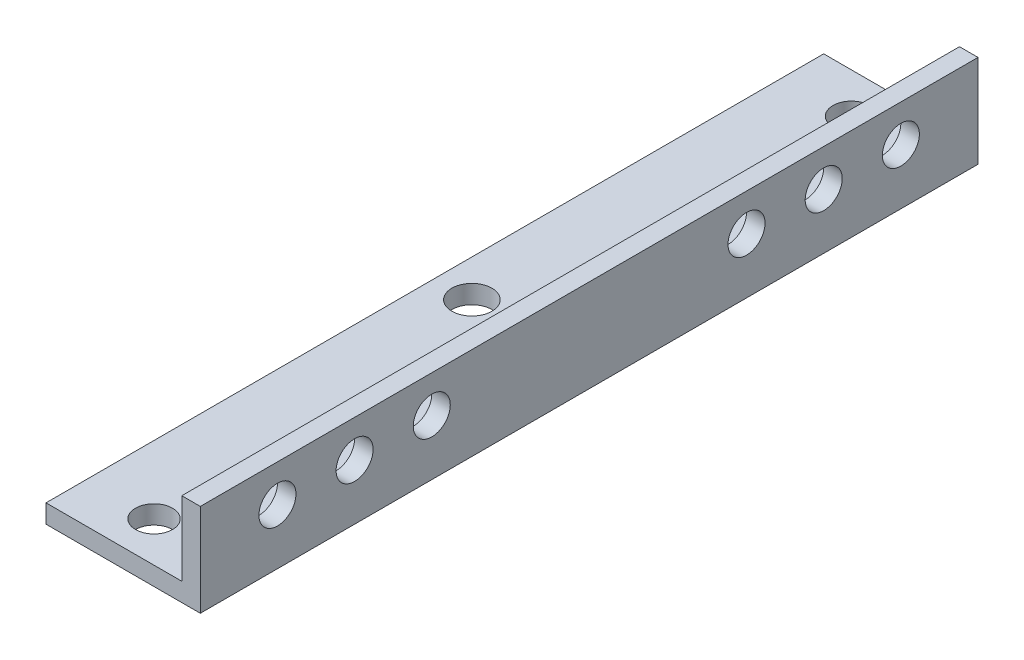
ISO-10303-21;
HEADER;
FILE_DESCRIPTION(('STEP AP214'),'2;1');
FILE_NAME('part.step','',(''),(''),'','','');
FILE_SCHEMA(('AUTOMOTIVE_DESIGN { 1 0 10303 214 1 1 1 1 }'));
ENDSEC;
DATA;
#1=APPLICATION_CONTEXT('core data for automotive mechanical design processes');
#2=APPLICATION_PROTOCOL_DEFINITION('international standard','automotive_design',2000,#1);
#3=PRODUCT_CONTEXT('',#1,'mechanical');
#4=PRODUCT('Part','Part','',(#3));
#5=PRODUCT_RELATED_PRODUCT_CATEGORY('part','',(#4));
#6=PRODUCT_DEFINITION_FORMATION('','',#4);
#7=PRODUCT_DEFINITION_CONTEXT('part definition',#1,'design');
#8=PRODUCT_DEFINITION('design','',#6,#7);
#9=PRODUCT_DEFINITION_SHAPE('','',#8);
#10=(LENGTH_UNIT() NAMED_UNIT(*) SI_UNIT(.MILLI.,.METRE.));
#11=(NAMED_UNIT(*) PLANE_ANGLE_UNIT() SI_UNIT($,.RADIAN.));
#12=(NAMED_UNIT(*) SI_UNIT($,.STERADIAN.) SOLID_ANGLE_UNIT());
#13=UNCERTAINTY_MEASURE_WITH_UNIT(LENGTH_MEASURE(1.E-05),#10,'distance_accuracy_value','');
#14=(GEOMETRIC_REPRESENTATION_CONTEXT(3) GLOBAL_UNCERTAINTY_ASSIGNED_CONTEXT((#13)) GLOBAL_UNIT_ASSIGNED_CONTEXT((#10,
#11,#12)) REPRESENTATION_CONTEXT('',''));
#15=CARTESIAN_POINT('',(0.,0.,0.));
#16=DIRECTION('',(0.,0.,1.));
#17=DIRECTION('',(1.,0.,0.));
#18=AXIS2_PLACEMENT_3D('',#15,#16,#17);
#19=CARTESIAN_POINT('',(0.,-12.,126.));
#20=DIRECTION('',(1.,0.,0.));
#21=DIRECTION('',(0.,0.,-1.));
#22=AXIS2_PLACEMENT_3D('',#19,#20,#21);
#23=PLANE('',#22);
#24=CARTESIAN_POINT('',(0.,-6.,12.5));
#25=DIRECTION('',(1.,0.,0.));
#26=DIRECTION('',(0.,0.,-1.));
#27=AXIS2_PLACEMENT_3D('',#24,#25,#26);
#28=CIRCLE('',#27,3.00000000000001);
#29=CARTESIAN_POINT('',(0.,-6.,9.49999999999999));
#30=VERTEX_POINT('',#29);
#31=EDGE_CURVE('E135',#30,#30,#28,.T.);
#32=ORIENTED_EDGE('',*,*,#31,.T.);
#33=EDGE_LOOP('',(#32));
#34=FACE_BOUND('',#33,.T.);
#35=CARTESIAN_POINT('',(0.,-6.,37.5));
#36=DIRECTION('',(1.,0.,0.));
#37=DIRECTION('',(0.,0.,-1.));
#38=AXIS2_PLACEMENT_3D('',#35,#36,#37);
#39=CIRCLE('',#38,3.00000000000001);
#40=CARTESIAN_POINT('',(0.,-6.,34.5));
#41=VERTEX_POINT('',#40);
#42=EDGE_CURVE('E181',#41,#41,#39,.T.);
#43=ORIENTED_EDGE('',*,*,#42,.T.);
#44=EDGE_LOOP('',(#43));
#45=FACE_BOUND('',#44,.T.);
#46=CARTESIAN_POINT('',(0.,-6.,25.));
#47=DIRECTION('',(1.,0.,0.));
#48=DIRECTION('',(0.,0.,-1.));
#49=AXIS2_PLACEMENT_3D('',#46,#47,#48);
#50=CIRCLE('',#49,3.00000000000001);
#51=CARTESIAN_POINT('',(0.,-6.,22.));
#52=VERTEX_POINT('',#51);
#53=EDGE_CURVE('E176',#52,#52,#50,.T.);
#54=ORIENTED_EDGE('',*,*,#53,.T.);
#55=EDGE_LOOP('',(#54));
#56=FACE_BOUND('',#55,.T.);
#57=CARTESIAN_POINT('',(0.,-6.,88.5));
#58=DIRECTION('',(1.,0.,0.));
#59=DIRECTION('',(0.,0.,-1.));
#60=AXIS2_PLACEMENT_3D('',#57,#58,#59);
#61=CIRCLE('',#60,3.00000000000001);
#62=CARTESIAN_POINT('',(0.,-6.,85.5));
#63=VERTEX_POINT('',#62);
#64=EDGE_CURVE('E171',#63,#63,#61,.T.);
#65=ORIENTED_EDGE('',*,*,#64,.T.);
#66=EDGE_LOOP('',(#65));
#67=FACE_BOUND('',#66,.T.);
#68=CARTESIAN_POINT('',(0.,-6.,101.));
#69=DIRECTION('',(1.,0.,0.));
#70=DIRECTION('',(0.,0.,-1.));
#71=AXIS2_PLACEMENT_3D('',#68,#69,#70);
#72=CIRCLE('',#71,3.00000000000001);
#73=CARTESIAN_POINT('',(0.,-6.,98.));
#74=VERTEX_POINT('',#73);
#75=EDGE_CURVE('E166',#74,#74,#72,.T.);
#76=ORIENTED_EDGE('',*,*,#75,.T.);
#77=EDGE_LOOP('',(#76));
#78=FACE_BOUND('',#77,.T.);
#79=CARTESIAN_POINT('',(0.,-6.,113.5));
#80=DIRECTION('',(1.,0.,0.));
#81=DIRECTION('',(0.,0.,-1.));
#82=AXIS2_PLACEMENT_3D('',#79,#80,#81);
#83=CIRCLE('',#82,3.00000000000001);
#84=CARTESIAN_POINT('',(0.,-6.,110.5));
#85=VERTEX_POINT('',#84);
#86=EDGE_CURVE('E161',#85,#85,#83,.T.);
#87=ORIENTED_EDGE('',*,*,#86,.T.);
#88=EDGE_LOOP('',(#87));
#89=FACE_BOUND('',#88,.T.);
#90=DIRECTION('',(0.,-1.,0.));
#91=VECTOR('',#90,1.);
#92=CARTESIAN_POINT('',(0.,-12.,0.));
#93=LINE('',#92,#91);
#94=CARTESIAN_POINT('',(0.,0.,0.));
#95=VERTEX_POINT('',#94);
#96=CARTESIAN_POINT('',(0.,-12.,0.));
#97=VERTEX_POINT('',#96);
#98=EDGE_CURVE('E130',#95,#97,#93,.T.);
#99=ORIENTED_EDGE('',*,*,#98,.T.);
#100=DIRECTION('',(0.,0.,-1.));
#101=VECTOR('',#100,1.);
#102=CARTESIAN_POINT('',(0.,-12.,126.));
#103=LINE('',#102,#101);
#104=CARTESIAN_POINT('',(0.,-12.,126.));
#105=VERTEX_POINT('',#104);
#106=EDGE_CURVE('E11',#105,#97,#103,.T.);
#107=ORIENTED_EDGE('',*,*,#106,.F.);
#108=DIRECTION('',(0.,-1.,0.));
#109=VECTOR('',#108,1.);
#110=CARTESIAN_POINT('',(0.,-12.,126.));
#111=LINE('',#110,#109);
#112=CARTESIAN_POINT('',(0.,0.,126.));
#113=VERTEX_POINT('',#112);
#114=EDGE_CURVE('E147',#113,#105,#111,.T.);
#115=ORIENTED_EDGE('',*,*,#114,.F.);
#116=DIRECTION('',(0.,0.,-1.));
#117=VECTOR('',#116,1.);
#118=CARTESIAN_POINT('',(0.,0.,126.));
#119=LINE('',#118,#117);
#120=EDGE_CURVE('E126',#113,#95,#119,.T.);
#121=ORIENTED_EDGE('',*,*,#120,.T.);
#122=EDGE_LOOP('',(#99,#107,#115,#121));
#123=FACE_BOUND('',#122,.T.);
#124=ADVANCED_FACE('F39',(#34,#45,#56,#67,#78,#89,#123),#23,.F.);
#125=CARTESIAN_POINT('',(-22.,-12.,126.));
#126=DIRECTION('',(0.,-1.,0.));
#127=DIRECTION('',(1.,0.,0.));
#128=AXIS2_PLACEMENT_3D('',#125,#126,#127);
#129=PLANE('',#128);
#130=CARTESIAN_POINT('',(-11.,-12.,6.5));
#131=DIRECTION('',(0.,1.,0.));
#132=DIRECTION('',(-1.,0.,0.));
#133=AXIS2_PLACEMENT_3D('',#130,#131,#132);
#134=CIRCLE('',#133,3.);
#135=CARTESIAN_POINT('',(-14.,-12.,6.5));
#136=VERTEX_POINT('',#135);
#137=EDGE_CURVE('E191',#136,#136,#134,.T.);
#138=ORIENTED_EDGE('',*,*,#137,.F.);
#139=EDGE_LOOP('',(#138));
#140=FACE_BOUND('',#139,.T.);
#141=CARTESIAN_POINT('',(-6.00000000000001,-12.,63.));
#142=DIRECTION('',(0.,1.,0.));
#143=DIRECTION('',(-1.,0.,0.));
#144=AXIS2_PLACEMENT_3D('',#141,#142,#143);
#145=CIRCLE('',#144,3.35113060799376);
#146=CARTESIAN_POINT('',(-9.35113060799377,-12.,63.));
#147=VERTEX_POINT('',#146);
#148=EDGE_CURVE('E272',#147,#147,#145,.T.);
#149=ORIENTED_EDGE('',*,*,#148,.F.);
#150=EDGE_LOOP('',(#149));
#151=FACE_BOUND('',#150,.T.);
#152=CARTESIAN_POINT('',(-16.,-12.,63.));
#153=DIRECTION('',(0.,1.,0.));
#154=DIRECTION('',(-1.,0.,0.));
#155=AXIS2_PLACEMENT_3D('',#152,#153,#154);
#156=CIRCLE('',#155,3.24343735278541);
#157=CARTESIAN_POINT('',(-19.2434373527854,-12.,63.));
#158=VERTEX_POINT('',#157);
#159=EDGE_CURVE('E267',#158,#158,#156,.T.);
#160=ORIENTED_EDGE('',*,*,#159,.F.);
#161=EDGE_LOOP('',(#160));
#162=FACE_BOUND('',#161,.T.);
#163=CARTESIAN_POINT('',(-11.,-12.,119.5));
#164=DIRECTION('',(0.,1.,0.));
#165=DIRECTION('',(1.,0.,0.));
#166=AXIS2_PLACEMENT_3D('',#163,#164,#165);
#167=CIRCLE('',#166,3.00000000000001);
#168=CARTESIAN_POINT('',(-8.,-12.,119.5));
#169=VERTEX_POINT('',#168);
#170=EDGE_CURVE('E271',#169,#169,#167,.T.);
#171=ORIENTED_EDGE('',*,*,#170,.F.);
#172=EDGE_LOOP('',(#171));
#173=FACE_BOUND('',#172,.T.);
#174=DIRECTION('',(-1.,0.,0.));
#175=VECTOR('',#174,1.);
#176=CARTESIAN_POINT('',(-22.,-12.,0.));
#177=LINE('',#176,#175);
#178=CARTESIAN_POINT('',(-22.,-12.,0.));
#179=VERTEX_POINT('',#178);
#180=EDGE_CURVE('E134',#97,#179,#177,.T.);
#181=ORIENTED_EDGE('',*,*,#180,.T.);
#182=DIRECTION('',(0.,0.,-1.));
#183=VECTOR('',#182,1.);
#184=CARTESIAN_POINT('',(-22.,-12.,126.));
#185=LINE('',#184,#183);
#186=CARTESIAN_POINT('',(-22.,-12.,126.));
#187=VERTEX_POINT('',#186);
#188=EDGE_CURVE('E49',#187,#179,#185,.T.);
#189=ORIENTED_EDGE('',*,*,#188,.F.);
#190=DIRECTION('',(-1.,0.,0.));
#191=VECTOR('',#190,1.);
#192=CARTESIAN_POINT('',(-22.,-12.,126.));
#193=LINE('',#192,#191);
#194=EDGE_CURVE('E95',#105,#187,#193,.T.);
#195=ORIENTED_EDGE('',*,*,#194,.F.);
#196=ORIENTED_EDGE('',*,*,#106,.T.);
#197=EDGE_LOOP('',(#181,#189,#195,#196));
#198=FACE_BOUND('',#197,.T.);
#199=ADVANCED_FACE('F217',(#140,#151,#162,#173,#198),#129,.F.);
#200=CARTESIAN_POINT('',(-22.,-15.,126.));
#201=DIRECTION('',(1.,0.,0.));
#202=DIRECTION('',(0.,0.,-1.));
#203=AXIS2_PLACEMENT_3D('',#200,#201,#202);
#204=PLANE('',#203);
#205=DIRECTION('',(0.,-1.,0.));
#206=VECTOR('',#205,1.);
#207=CARTESIAN_POINT('',(-22.,-15.,0.));
#208=LINE('',#207,#206);
#209=CARTESIAN_POINT('',(-22.,-15.,0.));
#210=VERTEX_POINT('',#209);
#211=EDGE_CURVE('E138',#179,#210,#208,.T.);
#212=ORIENTED_EDGE('',*,*,#211,.T.);
#213=DIRECTION('',(0.,0.,-1.));
#214=VECTOR('',#213,1.);
#215=CARTESIAN_POINT('',(-22.,-15.,126.));
#216=LINE('',#215,#214);
#217=CARTESIAN_POINT('',(-22.,-15.,126.));
#218=VERTEX_POINT('',#217);
#219=EDGE_CURVE('E119',#218,#210,#216,.T.);
#220=ORIENTED_EDGE('',*,*,#219,.F.);
#221=DIRECTION('',(0.,-1.,0.));
#222=VECTOR('',#221,1.);
#223=CARTESIAN_POINT('',(-22.,-15.,126.));
#224=LINE('',#223,#222);
#225=EDGE_CURVE('E108',#187,#218,#224,.T.);
#226=ORIENTED_EDGE('',*,*,#225,.F.);
#227=ORIENTED_EDGE('',*,*,#188,.T.);
#228=EDGE_LOOP('',(#212,#220,#226,#227));
#229=FACE_BOUND('',#228,.T.);
#230=ADVANCED_FACE('F222',(#229),#204,.F.);
#231=CARTESIAN_POINT('',(3.,-15.,126.));
#232=DIRECTION('',(0.,1.,0.));
#233=DIRECTION('',(-1.,0.,0.));
#234=AXIS2_PLACEMENT_3D('',#231,#232,#233);
#235=PLANE('',#234);
#236=CARTESIAN_POINT('',(-11.,-15.,6.5));
#237=DIRECTION('',(0.,1.,0.));
#238=DIRECTION('',(-1.,0.,0.));
#239=AXIS2_PLACEMENT_3D('',#236,#237,#238);
#240=CIRCLE('',#239,3.);
#241=CARTESIAN_POINT('',(-14.,-15.,6.5));
#242=VERTEX_POINT('',#241);
#243=EDGE_CURVE('E42',#242,#242,#240,.T.);
#244=ORIENTED_EDGE('',*,*,#243,.T.);
#245=EDGE_LOOP('',(#244));
#246=FACE_BOUND('',#245,.T.);
#247=CARTESIAN_POINT('',(-6.,-15.,63.));
#248=DIRECTION('',(0.,1.,0.));
#249=DIRECTION('',(-1.,0.,0.));
#250=AXIS2_PLACEMENT_3D('',#247,#248,#249);
#251=CIRCLE('',#250,3.35113060799376);
#252=CARTESIAN_POINT('',(-9.35113060799377,-15.,63.));
#253=VERTEX_POINT('',#252);
#254=EDGE_CURVE('E194',#253,#253,#251,.T.);
#255=ORIENTED_EDGE('',*,*,#254,.T.);
#256=EDGE_LOOP('',(#255));
#257=FACE_BOUND('',#256,.T.);
#258=CARTESIAN_POINT('',(-16.,-15.,63.));
#259=DIRECTION('',(0.,1.,0.));
#260=DIRECTION('',(-1.,0.,0.));
#261=AXIS2_PLACEMENT_3D('',#258,#259,#260);
#262=CIRCLE('',#261,3.24343735278541);
#263=CARTESIAN_POINT('',(-19.2434373527854,-15.,63.));
#264=VERTEX_POINT('',#263);
#265=EDGE_CURVE('E190',#264,#264,#262,.T.);
#266=ORIENTED_EDGE('',*,*,#265,.T.);
#267=EDGE_LOOP('',(#266));
#268=FACE_BOUND('',#267,.T.);
#269=CARTESIAN_POINT('',(-11.,-15.,119.5));
#270=DIRECTION('',(0.,1.,0.));
#271=DIRECTION('',(-1.,0.,0.));
#272=AXIS2_PLACEMENT_3D('',#269,#270,#271);
#273=CIRCLE('',#272,3.00000000000001);
#274=CARTESIAN_POINT('',(-14.,-15.,119.5));
#275=VERTEX_POINT('',#274);
#276=EDGE_CURVE('E186',#275,#275,#273,.T.);
#277=ORIENTED_EDGE('',*,*,#276,.T.);
#278=EDGE_LOOP('',(#277));
#279=FACE_BOUND('',#278,.T.);
#280=DIRECTION('',(1.,0.,0.));
#281=VECTOR('',#280,1.);
#282=CARTESIAN_POINT('',(3.,-15.,0.));
#283=LINE('',#282,#281);
#284=CARTESIAN_POINT('',(3.,-15.,0.));
#285=VERTEX_POINT('',#284);
#286=EDGE_CURVE('E117',#210,#285,#283,.T.);
#287=ORIENTED_EDGE('',*,*,#286,.T.);
#288=DIRECTION('',(0.,0.,-1.));
#289=VECTOR('',#288,1.);
#290=CARTESIAN_POINT('',(3.,-15.,126.));
#291=LINE('',#290,#289);
#292=CARTESIAN_POINT('',(3.,-15.,126.));
#293=VERTEX_POINT('',#292);
#294=EDGE_CURVE('E114',#293,#285,#291,.T.);
#295=ORIENTED_EDGE('',*,*,#294,.F.);
#296=DIRECTION('',(1.,0.,0.));
#297=VECTOR('',#296,1.);
#298=CARTESIAN_POINT('',(3.,-15.,126.));
#299=LINE('',#298,#297);
#300=EDGE_CURVE('E102',#218,#293,#299,.T.);
#301=ORIENTED_EDGE('',*,*,#300,.F.);
#302=ORIENTED_EDGE('',*,*,#219,.T.);
#303=EDGE_LOOP('',(#287,#295,#301,#302));
#304=FACE_BOUND('',#303,.T.);
#305=ADVANCED_FACE('F115',(#246,#257,#268,#279,#304),#235,.F.);
#306=CARTESIAN_POINT('',(3.,0.,126.));
#307=DIRECTION('',(-1.,0.,0.));
#308=DIRECTION('',(0.,-1.,0.));
#309=AXIS2_PLACEMENT_3D('',#306,#307,#308);
#310=PLANE('',#309);
#311=CARTESIAN_POINT('',(3.,-6.,12.5));
#312=DIRECTION('',(-1.,0.,0.));
#313=DIRECTION('',(0.,-1.,0.));
#314=AXIS2_PLACEMENT_3D('',#311,#312,#313);
#315=CIRCLE('',#314,3.00000000000001);
#316=CARTESIAN_POINT('',(3.,-9.00000000000001,12.5));
#317=VERTEX_POINT('',#316);
#318=EDGE_CURVE('E182',#317,#317,#315,.T.);
#319=ORIENTED_EDGE('',*,*,#318,.T.);
#320=EDGE_LOOP('',(#319));
#321=FACE_BOUND('',#320,.T.);
#322=CARTESIAN_POINT('',(3.,-6.,37.5));
#323=DIRECTION('',(-1.,0.,0.));
#324=DIRECTION('',(0.,-1.,0.));
#325=AXIS2_PLACEMENT_3D('',#322,#323,#324);
#326=CIRCLE('',#325,3.00000000000001);
#327=CARTESIAN_POINT('',(3.,-9.00000000000001,37.5));
#328=VERTEX_POINT('',#327);
#329=EDGE_CURVE('E177',#328,#328,#326,.T.);
#330=ORIENTED_EDGE('',*,*,#329,.T.);
#331=EDGE_LOOP('',(#330));
#332=FACE_BOUND('',#331,.T.);
#333=CARTESIAN_POINT('',(3.,-6.,25.));
#334=DIRECTION('',(-1.,0.,0.));
#335=DIRECTION('',(0.,-1.,0.));
#336=AXIS2_PLACEMENT_3D('',#333,#334,#335);
#337=CIRCLE('',#336,3.00000000000001);
#338=CARTESIAN_POINT('',(3.,-9.00000000000001,25.));
#339=VERTEX_POINT('',#338);
#340=EDGE_CURVE('E172',#339,#339,#337,.T.);
#341=ORIENTED_EDGE('',*,*,#340,.T.);
#342=EDGE_LOOP('',(#341));
#343=FACE_BOUND('',#342,.T.);
#344=CARTESIAN_POINT('',(3.,-6.,88.5));
#345=DIRECTION('',(-1.,0.,0.));
#346=DIRECTION('',(0.,-1.,0.));
#347=AXIS2_PLACEMENT_3D('',#344,#345,#346);
#348=CIRCLE('',#347,3.00000000000001);
#349=CARTESIAN_POINT('',(3.,-9.00000000000001,88.5));
#350=VERTEX_POINT('',#349);
#351=EDGE_CURVE('E167',#350,#350,#348,.T.);
#352=ORIENTED_EDGE('',*,*,#351,.T.);
#353=EDGE_LOOP('',(#352));
#354=FACE_BOUND('',#353,.T.);
#355=CARTESIAN_POINT('',(3.,-6.,101.));
#356=DIRECTION('',(-1.,0.,0.));
#357=DIRECTION('',(0.,-1.,0.));
#358=AXIS2_PLACEMENT_3D('',#355,#356,#357);
#359=CIRCLE('',#358,3.00000000000001);
#360=CARTESIAN_POINT('',(3.,-9.00000000000001,101.));
#361=VERTEX_POINT('',#360);
#362=EDGE_CURVE('E162',#361,#361,#359,.T.);
#363=ORIENTED_EDGE('',*,*,#362,.T.);
#364=EDGE_LOOP('',(#363));
#365=FACE_BOUND('',#364,.T.);
#366=CARTESIAN_POINT('',(3.,-6.,113.5));
#367=DIRECTION('',(-1.,0.,0.));
#368=DIRECTION('',(0.,-1.,0.));
#369=AXIS2_PLACEMENT_3D('',#366,#367,#368);
#370=CIRCLE('',#369,3.00000000000001);
#371=CARTESIAN_POINT('',(3.,-9.00000000000001,113.5));
#372=VERTEX_POINT('',#371);
#373=EDGE_CURVE('E157',#372,#372,#370,.T.);
#374=ORIENTED_EDGE('',*,*,#373,.T.);
#375=EDGE_LOOP('',(#374));
#376=FACE_BOUND('',#375,.T.);
#377=DIRECTION('',(0.,1.,0.));
#378=VECTOR('',#377,1.);
#379=CARTESIAN_POINT('',(3.,0.,0.));
#380=LINE('',#379,#378);
#381=CARTESIAN_POINT('',(3.,0.,0.));
#382=VERTEX_POINT('',#381);
#383=EDGE_CURVE('E81',#285,#382,#380,.T.);
#384=ORIENTED_EDGE('',*,*,#383,.T.);
#385=DIRECTION('',(0.,0.,-1.));
#386=VECTOR('',#385,1.);
#387=CARTESIAN_POINT('',(3.,0.,126.));
#388=LINE('',#387,#386);
#389=CARTESIAN_POINT('',(3.,0.,126.));
#390=VERTEX_POINT('',#389);
#391=EDGE_CURVE('E120',#390,#382,#388,.T.);
#392=ORIENTED_EDGE('',*,*,#391,.F.);
#393=DIRECTION('',(0.,1.,0.));
#394=VECTOR('',#393,1.);
#395=CARTESIAN_POINT('',(3.,0.,126.));
#396=LINE('',#395,#394);
#397=EDGE_CURVE('E106',#293,#390,#396,.T.);
#398=ORIENTED_EDGE('',*,*,#397,.F.);
#399=ORIENTED_EDGE('',*,*,#294,.T.);
#400=EDGE_LOOP('',(#384,#392,#398,#399));
#401=FACE_BOUND('',#400,.T.);
#402=ADVANCED_FACE('F122',(#321,#332,#343,#354,#365,#376,#401),#310,.F.);
#403=CARTESIAN_POINT('',(0.,0.,126.));
#404=DIRECTION('',(0.,-1.,0.));
#405=DIRECTION('',(0.,0.,-1.));
#406=AXIS2_PLACEMENT_3D('',#403,#404,#405);
#407=PLANE('',#406);
#408=DIRECTION('',(-1.,0.,0.));
#409=VECTOR('',#408,1.);
#410=CARTESIAN_POINT('',(0.,0.,0.));
#411=LINE('',#410,#409);
#412=EDGE_CURVE('E87',#382,#95,#411,.T.);
#413=ORIENTED_EDGE('',*,*,#412,.T.);
#414=ORIENTED_EDGE('',*,*,#120,.F.);
#415=DIRECTION('',(-1.,0.,0.));
#416=VECTOR('',#415,1.);
#417=CARTESIAN_POINT('',(0.,0.,126.));
#418=LINE('',#417,#416);
#419=EDGE_CURVE('E58',#390,#113,#418,.T.);
#420=ORIENTED_EDGE('',*,*,#419,.F.);
#421=ORIENTED_EDGE('',*,*,#391,.T.);
#422=EDGE_LOOP('',(#413,#414,#420,#421));
#423=FACE_BOUND('',#422,.T.);
#424=ADVANCED_FACE('F301',(#423),#407,.F.);
#425=CARTESIAN_POINT('',(0.,0.,126.));
#426=DIRECTION('',(0.,0.,-1.));
#427=DIRECTION('',(-1.,0.,0.));
#428=AXIS2_PLACEMENT_3D('',#425,#426,#427);
#429=PLANE('',#428);
#430=ORIENTED_EDGE('',*,*,#114,.T.);
#431=ORIENTED_EDGE('',*,*,#194,.T.);
#432=ORIENTED_EDGE('',*,*,#225,.T.);
#433=ORIENTED_EDGE('',*,*,#300,.T.);
#434=ORIENTED_EDGE('',*,*,#397,.T.);
#435=ORIENTED_EDGE('',*,*,#419,.T.);
#436=EDGE_LOOP('',(#430,#431,#432,#433,#434,#435));
#437=FACE_BOUND('',#436,.T.);
#438=ADVANCED_FACE('F104',(#437),#429,.F.);
#439=CARTESIAN_POINT('',(0.,0.,0.));
#440=DIRECTION('',(0.,0.,-1.));
#441=DIRECTION('',(-1.,0.,0.));
#442=AXIS2_PLACEMENT_3D('',#439,#440,#441);
#443=PLANE('',#442);
#444=ORIENTED_EDGE('',*,*,#98,.F.);
#445=ORIENTED_EDGE('',*,*,#412,.F.);
#446=ORIENTED_EDGE('',*,*,#383,.F.);
#447=ORIENTED_EDGE('',*,*,#286,.F.);
#448=ORIENTED_EDGE('',*,*,#211,.F.);
#449=ORIENTED_EDGE('',*,*,#180,.F.);
#450=EDGE_LOOP('',(#444,#445,#446,#447,#448,#449));
#451=FACE_BOUND('',#450,.T.);
#452=ADVANCED_FACE('F246',(#451),#443,.T.);
#453=CARTESIAN_POINT('',(-60.,-6.00000000000001,113.5));
#454=DIRECTION('',(1.,0.,0.));
#455=DIRECTION('',(0.,1.,0.));
#456=AXIS2_PLACEMENT_3D('',#453,#454,#455);
#457=CYLINDRICAL_SURFACE('',#456,3.00000000000001);
#458=ORIENTED_EDGE('',*,*,#373,.F.);
#459=EDGE_LOOP('',(#458));
#460=FACE_BOUND('',#459,.T.);
#461=ORIENTED_EDGE('',*,*,#86,.F.);
#462=EDGE_LOOP('',(#461));
#463=FACE_BOUND('',#462,.T.);
#464=ADVANCED_FACE('F310',(#460,#463),#457,.F.);
#465=CARTESIAN_POINT('',(-60.,-6.00000000000001,101.));
#466=DIRECTION('',(1.,0.,0.));
#467=DIRECTION('',(0.,1.,0.));
#468=AXIS2_PLACEMENT_3D('',#465,#466,#467);
#469=CYLINDRICAL_SURFACE('',#468,3.00000000000001);
#470=ORIENTED_EDGE('',*,*,#362,.F.);
#471=EDGE_LOOP('',(#470));
#472=FACE_BOUND('',#471,.T.);
#473=ORIENTED_EDGE('',*,*,#75,.F.);
#474=EDGE_LOOP('',(#473));
#475=FACE_BOUND('',#474,.T.);
#476=ADVANCED_FACE('F321',(#472,#475),#469,.F.);
#477=CARTESIAN_POINT('',(-60.,-6.00000000000001,88.5));
#478=DIRECTION('',(1.,0.,0.));
#479=DIRECTION('',(0.,1.,0.));
#480=AXIS2_PLACEMENT_3D('',#477,#478,#479);
#481=CYLINDRICAL_SURFACE('',#480,3.00000000000001);
#482=ORIENTED_EDGE('',*,*,#351,.F.);
#483=EDGE_LOOP('',(#482));
#484=FACE_BOUND('',#483,.T.);
#485=ORIENTED_EDGE('',*,*,#64,.F.);
#486=EDGE_LOOP('',(#485));
#487=FACE_BOUND('',#486,.T.);
#488=ADVANCED_FACE('F317',(#484,#487),#481,.F.);
#489=CARTESIAN_POINT('',(-60.,-6.00000000000001,25.));
#490=DIRECTION('',(1.,0.,0.));
#491=DIRECTION('',(0.,1.,0.));
#492=AXIS2_PLACEMENT_3D('',#489,#490,#491);
#493=CYLINDRICAL_SURFACE('',#492,3.00000000000001);
#494=ORIENTED_EDGE('',*,*,#340,.F.);
#495=EDGE_LOOP('',(#494));
#496=FACE_BOUND('',#495,.T.);
#497=ORIENTED_EDGE('',*,*,#53,.F.);
#498=EDGE_LOOP('',(#497));
#499=FACE_BOUND('',#498,.T.);
#500=ADVANCED_FACE('F313',(#496,#499),#493,.F.);
#501=CARTESIAN_POINT('',(-60.,-6.00000000000001,37.5));
#502=DIRECTION('',(1.,0.,0.));
#503=DIRECTION('',(0.,1.,0.));
#504=AXIS2_PLACEMENT_3D('',#501,#502,#503);
#505=CYLINDRICAL_SURFACE('',#504,3.00000000000001);
#506=ORIENTED_EDGE('',*,*,#329,.F.);
#507=EDGE_LOOP('',(#506));
#508=FACE_BOUND('',#507,.T.);
#509=ORIENTED_EDGE('',*,*,#42,.F.);
#510=EDGE_LOOP('',(#509));
#511=FACE_BOUND('',#510,.T.);
#512=ADVANCED_FACE('F316',(#508,#511),#505,.F.);
#513=CARTESIAN_POINT('',(-60.,-6.00000000000001,12.5));
#514=DIRECTION('',(1.,0.,0.));
#515=DIRECTION('',(0.,1.,0.));
#516=AXIS2_PLACEMENT_3D('',#513,#514,#515);
#517=CYLINDRICAL_SURFACE('',#516,3.00000000000001);
#518=ORIENTED_EDGE('',*,*,#318,.F.);
#519=EDGE_LOOP('',(#518));
#520=FACE_BOUND('',#519,.T.);
#521=ORIENTED_EDGE('',*,*,#31,.F.);
#522=EDGE_LOOP('',(#521));
#523=FACE_BOUND('',#522,.T.);
#524=ADVANCED_FACE('F291',(#520,#523),#517,.F.);
#525=CARTESIAN_POINT('',(-11.,-22.,119.5));
#526=DIRECTION('',(0.,1.,0.));
#527=DIRECTION('',(-1.,0.,0.));
#528=AXIS2_PLACEMENT_3D('',#525,#526,#527);
#529=CYLINDRICAL_SURFACE('',#528,3.00000000000001);
#530=ORIENTED_EDGE('',*,*,#170,.T.);
#531=EDGE_LOOP('',(#530));
#532=FACE_BOUND('',#531,.T.);
#533=ORIENTED_EDGE('',*,*,#276,.F.);
#534=EDGE_LOOP('',(#533));
#535=FACE_BOUND('',#534,.T.);
#536=ADVANCED_FACE('F288',(#532,#535),#529,.F.);
#537=CARTESIAN_POINT('',(-16.,-22.,63.));
#538=DIRECTION('',(0.,1.,0.));
#539=DIRECTION('',(-1.,0.,0.));
#540=AXIS2_PLACEMENT_3D('',#537,#538,#539);
#541=CYLINDRICAL_SURFACE('',#540,3.24343735278541);
#542=ORIENTED_EDGE('',*,*,#159,.T.);
#543=EDGE_LOOP('',(#542));
#544=FACE_BOUND('',#543,.T.);
#545=ORIENTED_EDGE('',*,*,#265,.F.);
#546=EDGE_LOOP('',(#545));
#547=FACE_BOUND('',#546,.T.);
#548=ADVANCED_FACE('F212',(#544,#547),#541,.F.);
#549=CARTESIAN_POINT('',(-6.,-22.,63.));
#550=DIRECTION('',(0.,1.,0.));
#551=DIRECTION('',(-1.,0.,0.));
#552=AXIS2_PLACEMENT_3D('',#549,#550,#551);
#553=CYLINDRICAL_SURFACE('',#552,3.35113060799376);
#554=ORIENTED_EDGE('',*,*,#148,.T.);
#555=EDGE_LOOP('',(#554));
#556=FACE_BOUND('',#555,.T.);
#557=ORIENTED_EDGE('',*,*,#254,.F.);
#558=EDGE_LOOP('',(#557));
#559=FACE_BOUND('',#558,.T.);
#560=ADVANCED_FACE('F206',(#556,#559),#553,.F.);
#561=CARTESIAN_POINT('',(-11.,-22.,6.5));
#562=DIRECTION('',(0.,1.,0.));
#563=DIRECTION('',(-1.,0.,0.));
#564=AXIS2_PLACEMENT_3D('',#561,#562,#563);
#565=CYLINDRICAL_SURFACE('',#564,3.);
#566=ORIENTED_EDGE('',*,*,#137,.T.);
#567=EDGE_LOOP('',(#566));
#568=FACE_BOUND('',#567,.T.);
#569=ORIENTED_EDGE('',*,*,#243,.F.);
#570=EDGE_LOOP('',(#569));
#571=FACE_BOUND('',#570,.T.);
#572=ADVANCED_FACE('F204',(#568,#571),#565,.F.);
#573=CLOSED_SHELL('',(#124,#199,#230,#305,#402,#424,#438,#452,#464,#476,#488,#500,#512,#524,
#536,#548,#560,#572));
#574=MANIFOLD_SOLID_BREP('B2',#573);
#575=ADVANCED_BREP_SHAPE_REPRESENTATION('',(#18,#574),#14);
#576=SHAPE_DEFINITION_REPRESENTATION(#9,#575);
ENDSEC;
END-ISO-10303-21;
